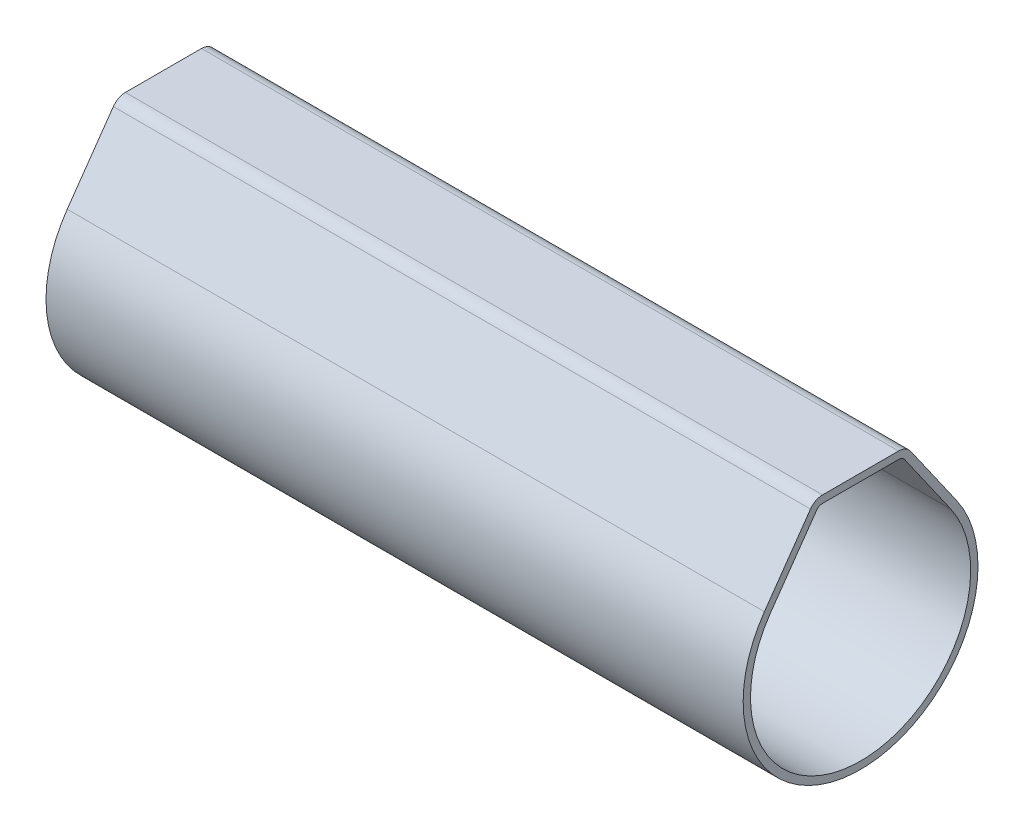
ISO-10303-21;
HEADER;
FILE_DESCRIPTION(('STEP AP214'),'2;1');
FILE_NAME('part.step','',(''),(''),'','','');
FILE_SCHEMA(('AUTOMOTIVE_DESIGN { 1 0 10303 214 1 1 1 1 }'));
ENDSEC;
DATA;
#1=APPLICATION_CONTEXT('core data for automotive mechanical design processes');
#2=APPLICATION_PROTOCOL_DEFINITION('international standard','automotive_design',2000,#1);
#3=PRODUCT_CONTEXT('',#1,'mechanical');
#4=PRODUCT('Part','Part','',(#3));
#5=PRODUCT_RELATED_PRODUCT_CATEGORY('part','',(#4));
#6=PRODUCT_DEFINITION_FORMATION('','',#4);
#7=PRODUCT_DEFINITION_CONTEXT('part definition',#1,'design');
#8=PRODUCT_DEFINITION('design','',#6,#7);
#9=PRODUCT_DEFINITION_SHAPE('','',#8);
#10=(LENGTH_UNIT() NAMED_UNIT(*) SI_UNIT(.MILLI.,.METRE.));
#11=(NAMED_UNIT(*) PLANE_ANGLE_UNIT() SI_UNIT($,.RADIAN.));
#12=(NAMED_UNIT(*) SI_UNIT($,.STERADIAN.) SOLID_ANGLE_UNIT());
#13=UNCERTAINTY_MEASURE_WITH_UNIT(LENGTH_MEASURE(1.E-05),#10,'distance_accuracy_value','');
#14=(GEOMETRIC_REPRESENTATION_CONTEXT(3) GLOBAL_UNCERTAINTY_ASSIGNED_CONTEXT((#13)) GLOBAL_UNIT_ASSIGNED_CONTEXT((#10,
#11,#12)) REPRESENTATION_CONTEXT('',''));
#15=CARTESIAN_POINT('',(0.,0.,0.));
#16=DIRECTION('',(0.,0.,1.));
#17=DIRECTION('',(1.,0.,0.));
#18=AXIS2_PLACEMENT_3D('',#15,#16,#17);
#19=CARTESIAN_POINT('',(95.,0.,0.));
#20=DIRECTION('',(1.,0.,0.));
#21=DIRECTION('',(0.,0.,-1.));
#22=AXIS2_PLACEMENT_3D('',#19,#20,#21);
#23=PLANE('',#22);
#24=DIRECTION('',(0.,0.819152044288993,0.573576436351044));
#25=VECTOR('',#24,1.);
#26=CARTESIAN_POINT('',(95.,19.,-6.22845019419885));
#27=LINE('',#26,#25);
#28=CARTESIAN_POINT('',(95.,9.17722298161671,-13.1064327086239));
#29=VERTEX_POINT('',#28);
#30=CARTESIAN_POINT('',(95.,18.1471528727021,-6.82562018167334));
#31=VERTEX_POINT('',#30);
#32=EDGE_CURVE('E184',#29,#31,#27,.T.);
#33=ORIENTED_EDGE('',*,*,#32,.T.);
#34=CARTESIAN_POINT('',(95.,17.,-5.18731609309535));
#35=DIRECTION('',(1.,0.,0.));
#36=DIRECTION('',(0.,0.,-1.));
#37=AXIS2_PLACEMENT_3D('',#34,#35,#36);
#38=CIRCLE('',#37,2.);
#39=CARTESIAN_POINT('',(95.,19.,-5.18731609309535));
#40=VERTEX_POINT('',#39);
#41=EDGE_CURVE('E221',#31,#40,#38,.T.);
#42=ORIENTED_EDGE('',*,*,#41,.T.);
#43=DIRECTION('',(0.,0.,1.));
#44=VECTOR('',#43,1.);
#45=CARTESIAN_POINT('',(95.,19.,6.22845019419885));
#46=LINE('',#45,#44);
#47=CARTESIAN_POINT('',(95.,19.,5.18731609309535));
#48=VERTEX_POINT('',#47);
#49=EDGE_CURVE('E188',#40,#48,#46,.T.);
#50=ORIENTED_EDGE('',*,*,#49,.T.);
#51=CARTESIAN_POINT('',(95.,17.,5.18731609309535));
#52=DIRECTION('',(1.,0.,0.));
#53=DIRECTION('',(0.,0.,-1.));
#54=AXIS2_PLACEMENT_3D('',#51,#52,#53);
#55=CIRCLE('',#54,2.);
#56=CARTESIAN_POINT('',(95.,18.1471528727021,6.82562018167334));
#57=VERTEX_POINT('',#56);
#58=EDGE_CURVE('E219',#48,#57,#55,.T.);
#59=ORIENTED_EDGE('',*,*,#58,.T.);
#60=DIRECTION('',(0.,-0.819152044288993,0.573576436351044));
#61=VECTOR('',#60,1.);
#62=CARTESIAN_POINT('',(95.,9.17722298161671,13.1064327086239));
#63=LINE('',#62,#61);
#64=CARTESIAN_POINT('',(95.,9.17722298161671,13.1064327086239));
#65=VERTEX_POINT('',#64);
#66=EDGE_CURVE('E191',#57,#65,#63,.T.);
#67=ORIENTED_EDGE('',*,*,#66,.T.);
#68=CARTESIAN_POINT('',(95.,0.,0.));
#69=DIRECTION('',(1.,0.,0.));
#70=DIRECTION('',(0.,0.,-1.));
#71=AXIS2_PLACEMENT_3D('',#68,#69,#70);
#72=CIRCLE('',#71,16.);
#73=EDGE_CURVE('E181',#65,#29,#72,.T.);
#74=ORIENTED_EDGE('',*,*,#73,.T.);
#75=EDGE_LOOP('',(#33,#42,#50,#59,#67,#74));
#76=FACE_BOUND('',#75,.T.);
#77=DIRECTION('',(0.,0.819152044288993,0.573576436351044));
#78=VECTOR('',#77,1.);
#79=CARTESIAN_POINT('',(95.,18.426423563649,-5.40929814990986));
#80=LINE('',#79,#78);
#81=CARTESIAN_POINT('',(95.,8.60364654526566,-12.2872806643349));
#82=VERTEX_POINT('',#81);
#83=CARTESIAN_POINT('',(95.,17.573576436351,-6.00646813738435));
#84=VERTEX_POINT('',#83);
#85=EDGE_CURVE('E157',#82,#84,#80,.T.);
#86=ORIENTED_EDGE('',*,*,#85,.F.);
#87=CARTESIAN_POINT('',(95.,0.,0.));
#88=DIRECTION('',(1.,0.,0.));
#89=DIRECTION('',(0.,0.,-1.));
#90=AXIS2_PLACEMENT_3D('',#87,#88,#89);
#91=CIRCLE('',#90,15.);
#92=CARTESIAN_POINT('',(95.,8.60364654526566,12.2872806643349));
#93=VERTEX_POINT('',#92);
#94=EDGE_CURVE('E148',#93,#82,#91,.T.);
#95=ORIENTED_EDGE('',*,*,#94,.F.);
#96=DIRECTION('',(0.,-0.819152044288993,0.573576436351044));
#97=VECTOR('',#96,1.);
#98=CARTESIAN_POINT('',(95.,8.60364654526566,12.2872806643349));
#99=LINE('',#98,#97);
#100=CARTESIAN_POINT('',(95.,17.573576436351,6.00646813738435));
#101=VERTEX_POINT('',#100);
#102=EDGE_CURVE('E169',#101,#93,#99,.T.);
#103=ORIENTED_EDGE('',*,*,#102,.F.);
#104=CARTESIAN_POINT('',(95.,17.,5.18731609309536));
#105=DIRECTION('',(1.,0.,0.));
#106=DIRECTION('',(0.,0.,-1.));
#107=AXIS2_PLACEMENT_3D('',#104,#105,#106);
#108=CIRCLE('',#107,1.);
#109=CARTESIAN_POINT('',(95.,18.,5.18731609309536));
#110=VERTEX_POINT('',#109);
#111=EDGE_CURVE('E237',#101,#110,#108,.F.);
#112=ORIENTED_EDGE('',*,*,#111,.T.);
#113=DIRECTION('',(0.,0.,1.));
#114=VECTOR('',#113,1.);
#115=CARTESIAN_POINT('',(95.,18.,6.22845019419885));
#116=LINE('',#115,#114);
#117=CARTESIAN_POINT('',(95.,18.,-5.18731609309535));
#118=VERTEX_POINT('',#117);
#119=EDGE_CURVE('E166',#118,#110,#116,.T.);
#120=ORIENTED_EDGE('',*,*,#119,.F.);
#121=CARTESIAN_POINT('',(95.,17.,-5.18731609309535));
#122=DIRECTION('',(1.,0.,0.));
#123=DIRECTION('',(0.,0.,-1.));
#124=AXIS2_PLACEMENT_3D('',#121,#122,#123);
#125=CIRCLE('',#124,1.);
#126=EDGE_CURVE('E12',#118,#84,#125,.F.);
#127=ORIENTED_EDGE('',*,*,#126,.T.);
#128=EDGE_LOOP('',(#86,#95,#103,#112,#120,#127));
#129=FACE_BOUND('',#128,.T.);
#130=ADVANCED_FACE('F58',(#76,#129),#23,.T.);
#131=CARTESIAN_POINT('',(0.,0.,0.));
#132=DIRECTION('',(1.,0.,0.));
#133=DIRECTION('',(0.,0.,-1.));
#134=AXIS2_PLACEMENT_3D('',#131,#132,#133);
#135=PLANE('',#134);
#136=DIRECTION('',(0.,0.,1.));
#137=VECTOR('',#136,1.);
#138=CARTESIAN_POINT('',(0.,19.,6.22845019419885));
#139=LINE('',#138,#137);
#140=CARTESIAN_POINT('',(0.,19.,-5.18731609309535));
#141=VERTEX_POINT('',#140);
#142=CARTESIAN_POINT('',(0.,19.,5.18731609309535));
#143=VERTEX_POINT('',#142);
#144=EDGE_CURVE('E199',#141,#143,#139,.T.);
#145=ORIENTED_EDGE('',*,*,#144,.F.);
#146=CARTESIAN_POINT('',(0.,17.,-5.18731609309535));
#147=DIRECTION('',(1.,0.,0.));
#148=DIRECTION('',(0.,0.,-1.));
#149=AXIS2_PLACEMENT_3D('',#146,#147,#148);
#150=CIRCLE('',#149,2.);
#151=CARTESIAN_POINT('',(0.,18.1471528727021,-6.82562018167334));
#152=VERTEX_POINT('',#151);
#153=EDGE_CURVE('E215',#141,#152,#150,.F.);
#154=ORIENTED_EDGE('',*,*,#153,.T.);
#155=DIRECTION('',(0.,0.819152044288993,0.573576436351044));
#156=VECTOR('',#155,1.);
#157=CARTESIAN_POINT('',(0.,19.,-6.22845019419885));
#158=LINE('',#157,#156);
#159=CARTESIAN_POINT('',(0.,9.17722298161671,-13.1064327086239));
#160=VERTEX_POINT('',#159);
#161=EDGE_CURVE('E196',#160,#152,#158,.T.);
#162=ORIENTED_EDGE('',*,*,#161,.F.);
#163=CARTESIAN_POINT('',(0.,0.,0.));
#164=DIRECTION('',(1.,0.,0.));
#165=DIRECTION('',(0.,0.,-1.));
#166=AXIS2_PLACEMENT_3D('',#163,#164,#165);
#167=CIRCLE('',#166,16.);
#168=CARTESIAN_POINT('',(0.,9.17722298161671,13.1064327086239));
#169=VERTEX_POINT('',#168);
#170=EDGE_CURVE('E164',#169,#160,#167,.T.);
#171=ORIENTED_EDGE('',*,*,#170,.F.);
#172=DIRECTION('',(0.,-0.819152044288993,0.573576436351044));
#173=VECTOR('',#172,1.);
#174=CARTESIAN_POINT('',(0.,9.17722298161671,13.1064327086239));
#175=LINE('',#174,#173);
#176=CARTESIAN_POINT('',(0.,18.1471528727021,6.82562018167334));
#177=VERTEX_POINT('',#176);
#178=EDGE_CURVE('E185',#177,#169,#175,.T.);
#179=ORIENTED_EDGE('',*,*,#178,.F.);
#180=CARTESIAN_POINT('',(0.,17.,5.18731609309535));
#181=DIRECTION('',(1.,0.,0.));
#182=DIRECTION('',(0.,0.,-1.));
#183=AXIS2_PLACEMENT_3D('',#180,#181,#182);
#184=CIRCLE('',#183,2.);
#185=EDGE_CURVE('E213',#177,#143,#184,.F.);
#186=ORIENTED_EDGE('',*,*,#185,.T.);
#187=EDGE_LOOP('',(#145,#154,#162,#171,#179,#186));
#188=FACE_BOUND('',#187,.T.);
#189=CARTESIAN_POINT('',(0.,0.,0.));
#190=DIRECTION('',(1.,0.,0.));
#191=DIRECTION('',(0.,0.,-1.));
#192=AXIS2_PLACEMENT_3D('',#189,#190,#191);
#193=CIRCLE('',#192,15.);
#194=CARTESIAN_POINT('',(0.,8.60364654526566,12.2872806643349));
#195=VERTEX_POINT('',#194);
#196=CARTESIAN_POINT('',(0.,8.60364654526566,-12.2872806643349));
#197=VERTEX_POINT('',#196);
#198=EDGE_CURVE('E173',#195,#197,#193,.T.);
#199=ORIENTED_EDGE('',*,*,#198,.T.);
#200=DIRECTION('',(0.,0.819152044288993,0.573576436351044));
#201=VECTOR('',#200,1.);
#202=CARTESIAN_POINT('',(0.,18.426423563649,-5.40929814990986));
#203=LINE('',#202,#201);
#204=CARTESIAN_POINT('',(0.,17.573576436351,-6.00646813738435));
#205=VERTEX_POINT('',#204);
#206=EDGE_CURVE('E163',#197,#205,#203,.T.);
#207=ORIENTED_EDGE('',*,*,#206,.T.);
#208=CARTESIAN_POINT('',(0.,17.,-5.18731609309535));
#209=DIRECTION('',(1.,0.,0.));
#210=DIRECTION('',(0.,0.,-1.));
#211=AXIS2_PLACEMENT_3D('',#208,#209,#210);
#212=CIRCLE('',#211,1.);
#213=CARTESIAN_POINT('',(0.,18.,-5.18731609309535));
#214=VERTEX_POINT('',#213);
#215=EDGE_CURVE('E66',#205,#214,#212,.T.);
#216=ORIENTED_EDGE('',*,*,#215,.T.);
#217=DIRECTION('',(0.,0.,1.));
#218=VECTOR('',#217,1.);
#219=CARTESIAN_POINT('',(0.,18.,6.22845019419885));
#220=LINE('',#219,#218);
#221=CARTESIAN_POINT('',(0.,18.,5.18731609309536));
#222=VERTEX_POINT('',#221);
#223=EDGE_CURVE('E176',#214,#222,#220,.T.);
#224=ORIENTED_EDGE('',*,*,#223,.T.);
#225=CARTESIAN_POINT('',(0.,17.,5.18731609309536));
#226=DIRECTION('',(1.,0.,0.));
#227=DIRECTION('',(0.,0.,-1.));
#228=AXIS2_PLACEMENT_3D('',#225,#226,#227);
#229=CIRCLE('',#228,1.);
#230=CARTESIAN_POINT('',(0.,17.573576436351,6.00646813738435));
#231=VERTEX_POINT('',#230);
#232=EDGE_CURVE('E235',#222,#231,#229,.T.);
#233=ORIENTED_EDGE('',*,*,#232,.T.);
#234=DIRECTION('',(0.,-0.819152044288993,0.573576436351044));
#235=VECTOR('',#234,1.);
#236=CARTESIAN_POINT('',(0.,8.60364654526566,12.2872806643349));
#237=LINE('',#236,#235);
#238=EDGE_CURVE('E158',#231,#195,#237,.T.);
#239=ORIENTED_EDGE('',*,*,#238,.T.);
#240=EDGE_LOOP('',(#199,#207,#216,#224,#233,#239));
#241=FACE_BOUND('',#240,.T.);
#242=ADVANCED_FACE('F240',(#188,#241),#135,.F.);
#243=CARTESIAN_POINT('',(95.,0.,0.));
#244=DIRECTION('',(-1.,0.,0.));
#245=DIRECTION('',(0.,0.,1.));
#246=AXIS2_PLACEMENT_3D('',#243,#244,#245);
#247=CYLINDRICAL_SURFACE('',#246,16.);
#248=ORIENTED_EDGE('',*,*,#170,.T.);
#249=DIRECTION('',(-1.,0.,0.));
#250=VECTOR('',#249,1.);
#251=CARTESIAN_POINT('',(95.,9.17722298161671,-13.1064327086239));
#252=LINE('',#251,#250);
#253=EDGE_CURVE('E205',#29,#160,#252,.T.);
#254=ORIENTED_EDGE('',*,*,#253,.F.);
#255=ORIENTED_EDGE('',*,*,#73,.F.);
#256=DIRECTION('',(-1.,0.,0.));
#257=VECTOR('',#256,1.);
#258=CARTESIAN_POINT('',(95.,9.17722298161671,13.1064327086239));
#259=LINE('',#258,#257);
#260=EDGE_CURVE('E193',#65,#169,#259,.T.);
#261=ORIENTED_EDGE('',*,*,#260,.T.);
#262=EDGE_LOOP('',(#248,#254,#255,#261));
#263=FACE_BOUND('',#262,.T.);
#264=ADVANCED_FACE('F257',(#263),#247,.T.);
#265=CARTESIAN_POINT('',(95.,19.,-6.22845019419885));
#266=DIRECTION('',(0.,-0.573576436351044,0.819152044288993));
#267=DIRECTION('',(0.,-0.819152044288993,-0.573576436351044));
#268=AXIS2_PLACEMENT_3D('',#265,#266,#267);
#269=PLANE('',#268);
#270=ORIENTED_EDGE('',*,*,#161,.T.);
#271=DIRECTION('',(-1.,0.,0.));
#272=VECTOR('',#271,1.);
#273=CARTESIAN_POINT('',(95.,18.1471528727021,-6.82562018167334));
#274=LINE('',#273,#272);
#275=EDGE_CURVE('E217',#152,#31,#274,.F.);
#276=ORIENTED_EDGE('',*,*,#275,.T.);
#277=ORIENTED_EDGE('',*,*,#32,.F.);
#278=ORIENTED_EDGE('',*,*,#253,.T.);
#279=EDGE_LOOP('',(#270,#276,#277,#278));
#280=FACE_BOUND('',#279,.T.);
#281=ADVANCED_FACE('F270',(#280),#269,.F.);
#282=CARTESIAN_POINT('',(95.,19.,6.22845019419885));
#283=DIRECTION('',(0.,-1.,0.));
#284=DIRECTION('',(0.,0.,-1.));
#285=AXIS2_PLACEMENT_3D('',#282,#283,#284);
#286=PLANE('',#285);
#287=ORIENTED_EDGE('',*,*,#49,.F.);
#288=DIRECTION('',(-1.,0.,0.));
#289=VECTOR('',#288,1.);
#290=CARTESIAN_POINT('',(95.,19.,-5.18731609309535));
#291=LINE('',#290,#289);
#292=EDGE_CURVE('E210',#40,#141,#291,.T.);
#293=ORIENTED_EDGE('',*,*,#292,.T.);
#294=ORIENTED_EDGE('',*,*,#144,.T.);
#295=DIRECTION('',(-1.,0.,0.));
#296=VECTOR('',#295,1.);
#297=CARTESIAN_POINT('',(95.,19.,5.18731609309535));
#298=LINE('',#297,#296);
#299=EDGE_CURVE('E208',#143,#48,#298,.F.);
#300=ORIENTED_EDGE('',*,*,#299,.T.);
#301=EDGE_LOOP('',(#287,#293,#294,#300));
#302=FACE_BOUND('',#301,.T.);
#303=ADVANCED_FACE('F266',(#302),#286,.F.);
#304=CARTESIAN_POINT('',(95.,9.17722298161671,13.1064327086239));
#305=DIRECTION('',(0.,-0.573576436351044,-0.819152044288993));
#306=DIRECTION('',(0.,0.819152044288993,-0.573576436351044));
#307=AXIS2_PLACEMENT_3D('',#304,#305,#306);
#308=PLANE('',#307);
#309=ORIENTED_EDGE('',*,*,#66,.F.);
#310=DIRECTION('',(-1.,0.,0.));
#311=VECTOR('',#310,1.);
#312=CARTESIAN_POINT('',(95.,18.1471528727021,6.82562018167334));
#313=LINE('',#312,#311);
#314=EDGE_CURVE('E223',#57,#177,#313,.T.);
#315=ORIENTED_EDGE('',*,*,#314,.T.);
#316=ORIENTED_EDGE('',*,*,#178,.T.);
#317=ORIENTED_EDGE('',*,*,#260,.F.);
#318=EDGE_LOOP('',(#309,#315,#316,#317));
#319=FACE_BOUND('',#318,.T.);
#320=ADVANCED_FACE('F263',(#319),#308,.F.);
#321=CARTESIAN_POINT('',(95.,0.,0.));
#322=DIRECTION('',(-1.,0.,0.));
#323=DIRECTION('',(0.,0.,1.));
#324=AXIS2_PLACEMENT_3D('',#321,#322,#323);
#325=CYLINDRICAL_SURFACE('',#324,15.);
#326=ORIENTED_EDGE('',*,*,#198,.F.);
#327=DIRECTION('',(-1.,0.,0.));
#328=VECTOR('',#327,1.);
#329=CARTESIAN_POINT('',(95.,8.60364654526566,12.2872806643349));
#330=LINE('',#329,#328);
#331=EDGE_CURVE('E155',#93,#195,#330,.T.);
#332=ORIENTED_EDGE('',*,*,#331,.F.);
#333=ORIENTED_EDGE('',*,*,#94,.T.);
#334=DIRECTION('',(-1.,0.,0.));
#335=VECTOR('',#334,1.);
#336=CARTESIAN_POINT('',(95.,8.60364654526566,-12.2872806643349));
#337=LINE('',#336,#335);
#338=EDGE_CURVE('E152',#82,#197,#337,.T.);
#339=ORIENTED_EDGE('',*,*,#338,.T.);
#340=EDGE_LOOP('',(#326,#332,#333,#339));
#341=FACE_BOUND('',#340,.T.);
#342=ADVANCED_FACE('F151',(#341),#325,.F.);
#343=CARTESIAN_POINT('',(95.,18.426423563649,-5.40929814990986));
#344=DIRECTION('',(0.,-0.573576436351044,0.819152044288993));
#345=DIRECTION('',(0.,-0.819152044288993,-0.573576436351044));
#346=AXIS2_PLACEMENT_3D('',#343,#344,#345);
#347=PLANE('',#346);
#348=ORIENTED_EDGE('',*,*,#85,.T.);
#349=DIRECTION('',(-1.,0.,0.));
#350=VECTOR('',#349,1.);
#351=CARTESIAN_POINT('',(0.,17.573576436351,-6.00646813738435));
#352=LINE('',#351,#350);
#353=EDGE_CURVE('E233',#84,#205,#352,.T.);
#354=ORIENTED_EDGE('',*,*,#353,.T.);
#355=ORIENTED_EDGE('',*,*,#206,.F.);
#356=ORIENTED_EDGE('',*,*,#338,.F.);
#357=EDGE_LOOP('',(#348,#354,#355,#356));
#358=FACE_BOUND('',#357,.T.);
#359=ADVANCED_FACE('F161',(#358),#347,.T.);
#360=CARTESIAN_POINT('',(95.,18.,6.22845019419885));
#361=DIRECTION('',(0.,-1.,0.));
#362=DIRECTION('',(0.,0.,-1.));
#363=AXIS2_PLACEMENT_3D('',#360,#361,#362);
#364=PLANE('',#363);
#365=ORIENTED_EDGE('',*,*,#119,.T.);
#366=DIRECTION('',(-1.,0.,0.));
#367=VECTOR('',#366,1.);
#368=CARTESIAN_POINT('',(0.,18.,5.18731609309536));
#369=LINE('',#368,#367);
#370=EDGE_CURVE('E228',#110,#222,#369,.T.);
#371=ORIENTED_EDGE('',*,*,#370,.T.);
#372=ORIENTED_EDGE('',*,*,#223,.F.);
#373=DIRECTION('',(-1.,0.,0.));
#374=VECTOR('',#373,1.);
#375=CARTESIAN_POINT('',(95.,18.,-5.18731609309535));
#376=LINE('',#375,#374);
#377=EDGE_CURVE('E226',#214,#118,#376,.F.);
#378=ORIENTED_EDGE('',*,*,#377,.T.);
#379=EDGE_LOOP('',(#365,#371,#372,#378));
#380=FACE_BOUND('',#379,.T.);
#381=ADVANCED_FACE('F242',(#380),#364,.T.);
#382=CARTESIAN_POINT('',(95.,8.60364654526566,12.2872806643349));
#383=DIRECTION('',(0.,-0.573576436351044,-0.819152044288993));
#384=DIRECTION('',(0.,0.819152044288993,-0.573576436351044));
#385=AXIS2_PLACEMENT_3D('',#382,#383,#384);
#386=PLANE('',#385);
#387=ORIENTED_EDGE('',*,*,#238,.F.);
#388=DIRECTION('',(-1.,0.,0.));
#389=VECTOR('',#388,1.);
#390=CARTESIAN_POINT('',(95.,17.573576436351,6.00646813738435));
#391=LINE('',#390,#389);
#392=EDGE_CURVE('E231',#231,#101,#391,.F.);
#393=ORIENTED_EDGE('',*,*,#392,.T.);
#394=ORIENTED_EDGE('',*,*,#102,.T.);
#395=ORIENTED_EDGE('',*,*,#331,.T.);
#396=EDGE_LOOP('',(#387,#393,#394,#395));
#397=FACE_BOUND('',#396,.T.);
#398=ADVANCED_FACE('F281',(#397),#386,.T.);
#399=CARTESIAN_POINT('',(95.,17.,-5.18731609309535));
#400=DIRECTION('',(-1.,0.,0.));
#401=DIRECTION('',(0.,0.,1.));
#402=AXIS2_PLACEMENT_3D('',#399,#400,#401);
#403=CYLINDRICAL_SURFACE('',#402,2.);
#404=ORIENTED_EDGE('',*,*,#41,.F.);
#405=ORIENTED_EDGE('',*,*,#275,.F.);
#406=ORIENTED_EDGE('',*,*,#153,.F.);
#407=ORIENTED_EDGE('',*,*,#292,.F.);
#408=EDGE_LOOP('',(#404,#405,#406,#407));
#409=FACE_BOUND('',#408,.T.);
#410=ADVANCED_FACE('F278',(#409),#403,.T.);
#411=CARTESIAN_POINT('',(95.,17.,5.18731609309535));
#412=DIRECTION('',(-1.,0.,0.));
#413=DIRECTION('',(0.,0.,1.));
#414=AXIS2_PLACEMENT_3D('',#411,#412,#413);
#415=CYLINDRICAL_SURFACE('',#414,2.);
#416=ORIENTED_EDGE('',*,*,#58,.F.);
#417=ORIENTED_EDGE('',*,*,#299,.F.);
#418=ORIENTED_EDGE('',*,*,#185,.F.);
#419=ORIENTED_EDGE('',*,*,#314,.F.);
#420=EDGE_LOOP('',(#416,#417,#418,#419));
#421=FACE_BOUND('',#420,.T.);
#422=ADVANCED_FACE('F249',(#421),#415,.T.);
#423=CARTESIAN_POINT('',(95.,17.,5.18731609309536));
#424=DIRECTION('',(1.,0.,0.));
#425=DIRECTION('',(0.,0.,-1.));
#426=AXIS2_PLACEMENT_3D('',#423,#424,#425);
#427=CYLINDRICAL_SURFACE('',#426,1.);
#428=ORIENTED_EDGE('',*,*,#111,.F.);
#429=ORIENTED_EDGE('',*,*,#392,.F.);
#430=ORIENTED_EDGE('',*,*,#232,.F.);
#431=ORIENTED_EDGE('',*,*,#370,.F.);
#432=EDGE_LOOP('',(#428,#429,#430,#431));
#433=FACE_BOUND('',#432,.T.);
#434=ADVANCED_FACE('F245',(#433),#427,.F.);
#435=CARTESIAN_POINT('',(95.,17.,-5.18731609309535));
#436=DIRECTION('',(1.,0.,0.));
#437=DIRECTION('',(0.,0.,-1.));
#438=AXIS2_PLACEMENT_3D('',#435,#436,#437);
#439=CYLINDRICAL_SURFACE('',#438,1.);
#440=ORIENTED_EDGE('',*,*,#126,.F.);
#441=ORIENTED_EDGE('',*,*,#377,.F.);
#442=ORIENTED_EDGE('',*,*,#215,.F.);
#443=ORIENTED_EDGE('',*,*,#353,.F.);
#444=EDGE_LOOP('',(#440,#441,#442,#443));
#445=FACE_BOUND('',#444,.T.);
#446=ADVANCED_FACE('F60',(#445),#439,.F.);
#447=CLOSED_SHELL('',(#130,#242,#264,#281,#303,#320,#342,#359,#381,#398,#410,#422,#434,#446));
#448=MANIFOLD_SOLID_BREP('B2',#447);
#449=ADVANCED_BREP_SHAPE_REPRESENTATION('',(#18,#448),#14);
#450=SHAPE_DEFINITION_REPRESENTATION(#9,#449);
ENDSEC;
END-ISO-10303-21;
